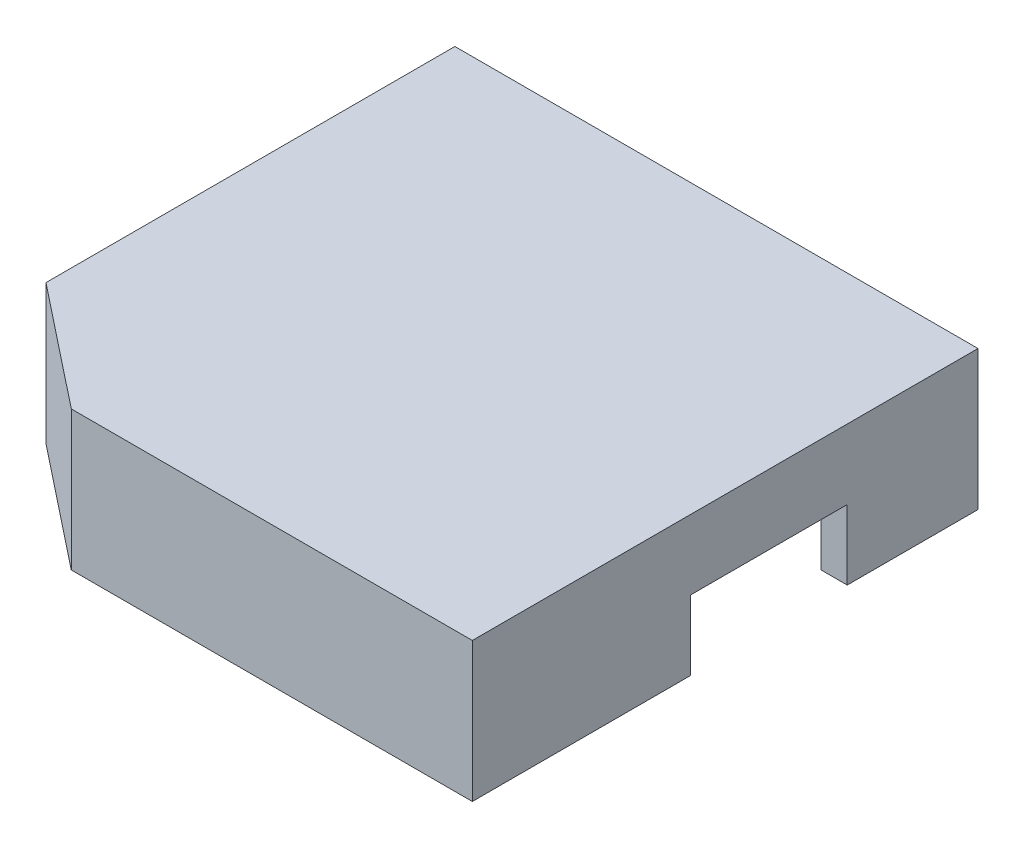
ISO-10303-21;
HEADER;
FILE_DESCRIPTION(('STEP AP214'),'2;1');
FILE_NAME('part.step','',(''),(''),'','','');
FILE_SCHEMA(('AUTOMOTIVE_DESIGN { 1 0 10303 214 1 1 1 1 }'));
ENDSEC;
DATA;
#1=APPLICATION_CONTEXT('core data for automotive mechanical design processes');
#2=APPLICATION_PROTOCOL_DEFINITION('international standard','automotive_design',2000,#1);
#3=PRODUCT_CONTEXT('',#1,'mechanical');
#4=PRODUCT('Part','Part','',(#3));
#5=PRODUCT_RELATED_PRODUCT_CATEGORY('part','',(#4));
#6=PRODUCT_DEFINITION_FORMATION('','',#4);
#7=PRODUCT_DEFINITION_CONTEXT('part definition',#1,'design');
#8=PRODUCT_DEFINITION('design','',#6,#7);
#9=PRODUCT_DEFINITION_SHAPE('','',#8);
#10=(LENGTH_UNIT() NAMED_UNIT(*) SI_UNIT(.MILLI.,.METRE.));
#11=(NAMED_UNIT(*) PLANE_ANGLE_UNIT() SI_UNIT($,.RADIAN.));
#12=(NAMED_UNIT(*) SI_UNIT($,.STERADIAN.) SOLID_ANGLE_UNIT());
#13=UNCERTAINTY_MEASURE_WITH_UNIT(LENGTH_MEASURE(1.E-05),#10,'distance_accuracy_value','');
#14=(GEOMETRIC_REPRESENTATION_CONTEXT(3) GLOBAL_UNCERTAINTY_ASSIGNED_CONTEXT((#13)) GLOBAL_UNIT_ASSIGNED_CONTEXT((#10,
#11,#12)) REPRESENTATION_CONTEXT('',''));
#15=CARTESIAN_POINT('',(0.,0.,0.));
#16=DIRECTION('',(0.,0.,1.));
#17=DIRECTION('',(1.,0.,0.));
#18=AXIS2_PLACEMENT_3D('',#15,#16,#17);
#19=CARTESIAN_POINT('',(0.,0.,0.));
#20=DIRECTION('',(0.,1.,0.));
#21=DIRECTION('',(0.,0.,1.));
#22=AXIS2_PLACEMENT_3D('',#19,#20,#21);
#23=PLANE('',#22);
#24=DIRECTION('',(0.,0.,-1.));
#25=VECTOR('',#24,1.);
#26=CARTESIAN_POINT('',(0.763392857142857,0.,-0.930803571428571));
#27=LINE('',#26,#25);
#28=CARTESIAN_POINT('',(0.763392857142872,0.,6.56919642857143));
#29=VERTEX_POINT('',#28);
#30=CARTESIAN_POINT('',(0.763392857142857,0.,-0.930803571428571));
#31=VERTEX_POINT('',#30);
#32=EDGE_CURVE('E184',#29,#31,#27,.T.);
#33=ORIENTED_EDGE('',*,*,#32,.F.);
#34=DIRECTION('',(-1.,0.,0.));
#35=VECTOR('',#34,1.);
#36=CARTESIAN_POINT('',(0.763392857142872,0.,6.56919642857143));
#37=LINE('',#36,#35);
#38=CARTESIAN_POINT('',(-0.736607142857139,0.,6.56919642857143));
#39=VERTEX_POINT('',#38);
#40=EDGE_CURVE('E165',#29,#39,#37,.T.);
#41=ORIENTED_EDGE('',*,*,#40,.T.);
#42=DIRECTION('',(0.,0.,1.));
#43=VECTOR('',#42,1.);
#44=CARTESIAN_POINT('',(-0.736607142857139,0.,0.569196428571429));
#45=LINE('',#44,#43);
#46=CARTESIAN_POINT('',(-0.736607142857139,0.,0.569196428571429));
#47=VERTEX_POINT('',#46);
#48=EDGE_CURVE('E284',#47,#39,#45,.T.);
#49=ORIENTED_EDGE('',*,*,#48,.F.);
#50=DIRECTION('',(1.,0.,0.));
#51=VECTOR('',#50,1.);
#52=CARTESIAN_POINT('',(-0.736607142857139,0.,0.569196428571429));
#53=LINE('',#52,#51);
#54=CARTESIAN_POINT('',(-27.7366071428571,0.,0.569196428571426));
#55=VERTEX_POINT('',#54);
#56=EDGE_CURVE('E267',#55,#47,#53,.T.);
#57=ORIENTED_EDGE('',*,*,#56,.F.);
#58=DIRECTION('',(0.,0.,-1.));
#59=VECTOR('',#58,1.);
#60=CARTESIAN_POINT('',(-27.7366071428571,0.,0.569196428571426));
#61=LINE('',#60,#59);
#62=CARTESIAN_POINT('',(-27.7366071428571,0.,6.56919642857143));
#63=VERTEX_POINT('',#62);
#64=EDGE_CURVE('E295',#63,#55,#61,.T.);
#65=ORIENTED_EDGE('',*,*,#64,.F.);
#66=CARTESIAN_POINT('',(-29.2366071428571,0.,6.56919642857143));
#67=VERTEX_POINT('',#66);
#68=EDGE_CURVE('E179',#63,#67,#37,.T.);
#69=ORIENTED_EDGE('',*,*,#68,.T.);
#70=DIRECTION('',(0.,0.,1.));
#71=VECTOR('',#70,1.);
#72=CARTESIAN_POINT('',(-29.2366071428571,0.,-0.930803571428571));
#73=LINE('',#72,#71);
#74=CARTESIAN_POINT('',(-29.2366071428571,0.,-0.930803571428571));
#75=VERTEX_POINT('',#74);
#76=EDGE_CURVE('E203',#75,#67,#73,.T.);
#77=ORIENTED_EDGE('',*,*,#76,.F.);
#78=DIRECTION('',(-1.,0.,0.));
#79=VECTOR('',#78,1.);
#80=CARTESIAN_POINT('',(-29.2366071428571,0.,-0.930803571428571));
#81=LINE('',#80,#79);
#82=EDGE_CURVE('E195',#31,#75,#81,.T.);
#83=ORIENTED_EDGE('',*,*,#82,.F.);
#84=EDGE_LOOP('',(#33,#41,#49,#57,#65,#69,#77,#83));
#85=FACE_BOUND('',#84,.T.);
#86=ADVANCED_FACE('F39',(#85),#23,.F.);
#87=CARTESIAN_POINT('',(-29.2366071428571,8.,-0.930803571428571));
#88=DIRECTION('',(1.,0.,0.));
#89=DIRECTION('',(0.,0.,-1.));
#90=AXIS2_PLACEMENT_3D('',#87,#88,#89);
#91=PLANE('',#90);
#92=ORIENTED_EDGE('',*,*,#76,.T.);
#93=DIRECTION('',(0.,-1.,0.));
#94=VECTOR('',#93,1.);
#95=CARTESIAN_POINT('',(-29.2366071428571,0.,6.56919642857143));
#96=LINE('',#95,#94);
#97=CARTESIAN_POINT('',(-29.2366071428571,4.,6.56919642857143));
#98=VERTEX_POINT('',#97);
#99=EDGE_CURVE('E379',#98,#67,#96,.T.);
#100=ORIENTED_EDGE('',*,*,#99,.F.);
#101=DIRECTION('',(0.,0.,-1.));
#102=VECTOR('',#101,1.);
#103=CARTESIAN_POINT('',(-29.2366071428571,4.,6.56919642857143));
#104=LINE('',#103,#102);
#105=CARTESIAN_POINT('',(-29.2366071428571,4.,15.5691964285714));
#106=VERTEX_POINT('',#105);
#107=EDGE_CURVE('E191',#106,#98,#104,.T.);
#108=ORIENTED_EDGE('',*,*,#107,.F.);
#109=DIRECTION('',(0.,1.,0.));
#110=VECTOR('',#109,1.);
#111=CARTESIAN_POINT('',(-29.2366071428571,0.,15.5691964285714));
#112=LINE('',#111,#110);
#113=CARTESIAN_POINT('',(-29.2366071428571,0.,15.5691964285714));
#114=VERTEX_POINT('',#113);
#115=EDGE_CURVE('E351',#114,#106,#112,.T.);
#116=ORIENTED_EDGE('',*,*,#115,.F.);
#117=CARTESIAN_POINT('',(-29.2366071428571,0.,22.5191407492151));
#118=VERTEX_POINT('',#117);
#119=EDGE_CURVE('E330',#114,#118,#73,.T.);
#120=ORIENTED_EDGE('',*,*,#119,.T.);
#121=DIRECTION('',(0.,1.,0.));
#122=VECTOR('',#121,1.);
#123=CARTESIAN_POINT('',(-29.2366071428571,0.,22.5191407492151));
#124=LINE('',#123,#122);
#125=CARTESIAN_POINT('',(-29.2366071428571,8.,22.5191407492151));
#126=VERTEX_POINT('',#125);
#127=EDGE_CURVE('E326',#118,#126,#124,.T.);
#128=ORIENTED_EDGE('',*,*,#127,.T.);
#129=DIRECTION('',(0.,0.,1.));
#130=VECTOR('',#129,1.);
#131=CARTESIAN_POINT('',(-29.2366071428571,8.,-0.930803571428571));
#132=LINE('',#131,#130);
#133=CARTESIAN_POINT('',(-29.2366071428571,8.,-0.930803571428571));
#134=VERTEX_POINT('',#133);
#135=EDGE_CURVE('E209',#134,#126,#132,.T.);
#136=ORIENTED_EDGE('',*,*,#135,.F.);
#137=DIRECTION('',(0.,-1.,0.));
#138=VECTOR('',#137,1.);
#139=CARTESIAN_POINT('',(-29.2366071428571,8.,-0.930803571428571));
#140=LINE('',#139,#138);
#141=EDGE_CURVE('E210',#134,#75,#140,.T.);
#142=ORIENTED_EDGE('',*,*,#141,.T.);
#143=EDGE_LOOP('',(#92,#100,#108,#116,#120,#128,#136,#142));
#144=FACE_BOUND('',#143,.T.);
#145=ADVANCED_FACE('F41',(#144),#91,.F.);
#146=CARTESIAN_POINT('',(-29.2366071428571,8.,28.0691964285714));
#147=DIRECTION('',(0.,0.,-1.));
#148=DIRECTION('',(-1.,0.,0.));
#149=AXIS2_PLACEMENT_3D('',#146,#147,#148);
#150=PLANE('',#149);
#151=DIRECTION('',(1.,0.,0.));
#152=VECTOR('',#151,1.);
#153=CARTESIAN_POINT('',(-29.2366071428571,8.,28.0691964285714));
#154=LINE('',#153,#152);
#155=CARTESIAN_POINT('',(-22.2366071428571,8.,28.0691964285714));
#156=VERTEX_POINT('',#155);
#157=CARTESIAN_POINT('',(0.763392857142861,8.,28.0691964285714));
#158=VERTEX_POINT('',#157);
#159=EDGE_CURVE('E336',#156,#158,#154,.T.);
#160=ORIENTED_EDGE('',*,*,#159,.F.);
#161=DIRECTION('',(0.,1.,0.));
#162=VECTOR('',#161,1.);
#163=CARTESIAN_POINT('',(-22.2366071428571,0.,28.0691964285714));
#164=LINE('',#163,#162);
#165=CARTESIAN_POINT('',(-22.2366071428571,0.,28.0691964285714));
#166=VERTEX_POINT('',#165);
#167=EDGE_CURVE('E323',#166,#156,#164,.T.);
#168=ORIENTED_EDGE('',*,*,#167,.F.);
#169=DIRECTION('',(1.,0.,0.));
#170=VECTOR('',#169,1.);
#171=CARTESIAN_POINT('',(-29.2366071428571,0.,28.0691964285714));
#172=LINE('',#171,#170);
#173=CARTESIAN_POINT('',(0.763392857142861,0.,28.0691964285714));
#174=VERTEX_POINT('',#173);
#175=EDGE_CURVE('E198',#166,#174,#172,.T.);
#176=ORIENTED_EDGE('',*,*,#175,.T.);
#177=DIRECTION('',(0.,-1.,0.));
#178=VECTOR('',#177,1.);
#179=CARTESIAN_POINT('',(0.763392857142861,8.,28.0691964285714));
#180=LINE('',#179,#178);
#181=EDGE_CURVE('E218',#158,#174,#180,.T.);
#182=ORIENTED_EDGE('',*,*,#181,.F.);
#183=EDGE_LOOP('',(#160,#168,#176,#182));
#184=FACE_BOUND('',#183,.T.);
#185=ADVANCED_FACE('F364',(#184),#150,.F.);
#186=CARTESIAN_POINT('',(0.763392857142857,8.,-0.930803571428571));
#187=DIRECTION('',(-1.,0.,0.));
#188=DIRECTION('',(0.,0.,1.));
#189=AXIS2_PLACEMENT_3D('',#186,#187,#188);
#190=PLANE('',#189);
#191=DIRECTION('',(0.,0.,-1.));
#192=VECTOR('',#191,1.);
#193=CARTESIAN_POINT('',(0.763392857142872,4.,6.56919642857143));
#194=LINE('',#193,#192);
#195=CARTESIAN_POINT('',(0.763392857142876,4.,15.5691964285714));
#196=VERTEX_POINT('',#195);
#197=CARTESIAN_POINT('',(0.763392857142872,4.,6.56919642857143));
#198=VERTEX_POINT('',#197);
#199=EDGE_CURVE('E188',#196,#198,#194,.T.);
#200=ORIENTED_EDGE('',*,*,#199,.T.);
#201=DIRECTION('',(0.,-1.,0.));
#202=VECTOR('',#201,1.);
#203=CARTESIAN_POINT('',(0.763392857142872,0.,6.56919642857143));
#204=LINE('',#203,#202);
#205=EDGE_CURVE('E169',#198,#29,#204,.T.);
#206=ORIENTED_EDGE('',*,*,#205,.T.);
#207=ORIENTED_EDGE('',*,*,#32,.T.);
#208=DIRECTION('',(0.,-1.,0.));
#209=VECTOR('',#208,1.);
#210=CARTESIAN_POINT('',(0.763392857142857,8.,-0.930803571428571));
#211=LINE('',#210,#209);
#212=CARTESIAN_POINT('',(0.763392857142857,8.,-0.930803571428571));
#213=VERTEX_POINT('',#212);
#214=EDGE_CURVE('E214',#213,#31,#211,.T.);
#215=ORIENTED_EDGE('',*,*,#214,.F.);
#216=DIRECTION('',(0.,0.,-1.));
#217=VECTOR('',#216,1.);
#218=CARTESIAN_POINT('',(0.763392857142857,8.,-0.930803571428571));
#219=LINE('',#218,#217);
#220=EDGE_CURVE('E339',#158,#213,#219,.T.);
#221=ORIENTED_EDGE('',*,*,#220,.F.);
#222=ORIENTED_EDGE('',*,*,#181,.T.);
#223=CARTESIAN_POINT('',(0.763392857142876,0.,15.5691964285714));
#224=VERTEX_POINT('',#223);
#225=EDGE_CURVE('E197',#174,#224,#27,.T.);
#226=ORIENTED_EDGE('',*,*,#225,.T.);
#227=DIRECTION('',(0.,1.,0.));
#228=VECTOR('',#227,1.);
#229=CARTESIAN_POINT('',(0.763392857142876,0.,15.5691964285714));
#230=LINE('',#229,#228);
#231=EDGE_CURVE('E190',#224,#196,#230,.T.);
#232=ORIENTED_EDGE('',*,*,#231,.T.);
#233=EDGE_LOOP('',(#200,#206,#207,#215,#221,#222,#226,#232));
#234=FACE_BOUND('',#233,.T.);
#235=ADVANCED_FACE('F182',(#234),#190,.F.);
#236=CARTESIAN_POINT('',(-29.2366071428571,8.,-0.930803571428571));
#237=DIRECTION('',(0.,0.,1.));
#238=DIRECTION('',(1.,0.,0.));
#239=AXIS2_PLACEMENT_3D('',#236,#237,#238);
#240=PLANE('',#239);
#241=ORIENTED_EDGE('',*,*,#82,.T.);
#242=ORIENTED_EDGE('',*,*,#141,.F.);
#243=DIRECTION('',(-1.,0.,0.));
#244=VECTOR('',#243,1.);
#245=CARTESIAN_POINT('',(-29.2366071428571,8.,-0.930803571428571));
#246=LINE('',#245,#244);
#247=EDGE_CURVE('E215',#213,#134,#246,.T.);
#248=ORIENTED_EDGE('',*,*,#247,.F.);
#249=ORIENTED_EDGE('',*,*,#214,.T.);
#250=EDGE_LOOP('',(#241,#242,#248,#249));
#251=FACE_BOUND('',#250,.T.);
#252=ADVANCED_FACE('F409',(#251),#240,.F.);
#253=CARTESIAN_POINT('',(0.,8.,0.));
#254=DIRECTION('',(0.,1.,0.));
#255=DIRECTION('',(0.,0.,1.));
#256=AXIS2_PLACEMENT_3D('',#253,#254,#255);
#257=PLANE('',#256);
#258=DIRECTION('',(-0.783588601449101,0.,-0.621280052535925));
#259=VECTOR('',#258,1.);
#260=CARTESIAN_POINT('',(-29.2366071428571,8.,22.5191407492151));
#261=LINE('',#260,#259);
#262=EDGE_CURVE('E305',#156,#126,#261,.T.);
#263=ORIENTED_EDGE('',*,*,#262,.F.);
#264=ORIENTED_EDGE('',*,*,#159,.T.);
#265=ORIENTED_EDGE('',*,*,#220,.T.);
#266=ORIENTED_EDGE('',*,*,#247,.T.);
#267=ORIENTED_EDGE('',*,*,#135,.T.);
#268=EDGE_LOOP('',(#263,#264,#265,#266,#267));
#269=FACE_BOUND('',#268,.T.);
#270=ADVANCED_FACE('F368',(#269),#257,.T.);
#271=ORIENTED_EDGE('',*,*,#119,.F.);
#272=DIRECTION('',(-1.,0.,0.));
#273=VECTOR('',#272,1.);
#274=CARTESIAN_POINT('',(0.763392857142876,0.,15.5691964285714));
#275=LINE('',#274,#273);
#276=CARTESIAN_POINT('',(-27.7366071428571,0.,15.5691964285714));
#277=VERTEX_POINT('',#276);
#278=EDGE_CURVE('E178',#277,#114,#275,.T.);
#279=ORIENTED_EDGE('',*,*,#278,.F.);
#280=CARTESIAN_POINT('',(-27.7366071428571,0.,21.7941685888933));
#281=VERTEX_POINT('',#280);
#282=EDGE_CURVE('E296',#281,#277,#61,.T.);
#283=ORIENTED_EDGE('',*,*,#282,.F.);
#284=DIRECTION('',(-0.783588601449101,0.,-0.621280052535925));
#285=VECTOR('',#284,1.);
#286=CARTESIAN_POINT('',(-27.7366071428571,0.,21.7941685888933));
#287=LINE('',#286,#285);
#288=CARTESIAN_POINT('',(-21.714109926825,0.,26.5691964285714));
#289=VERTEX_POINT('',#288);
#290=EDGE_CURVE('E291',#289,#281,#287,.T.);
#291=ORIENTED_EDGE('',*,*,#290,.F.);
#292=DIRECTION('',(-1.,0.,0.));
#293=VECTOR('',#292,1.);
#294=CARTESIAN_POINT('',(-21.714109926825,0.,26.5691964285714));
#295=LINE('',#294,#293);
#296=CARTESIAN_POINT('',(-0.73660714285714,0.,26.5691964285714));
#297=VERTEX_POINT('',#296);
#298=EDGE_CURVE('E287',#297,#289,#295,.T.);
#299=ORIENTED_EDGE('',*,*,#298,.F.);
#300=CARTESIAN_POINT('',(-0.736607142857139,0.,15.5691964285714));
#301=VERTEX_POINT('',#300);
#302=EDGE_CURVE('E261',#301,#297,#45,.T.);
#303=ORIENTED_EDGE('',*,*,#302,.F.);
#304=EDGE_CURVE('E55',#224,#301,#275,.T.);
#305=ORIENTED_EDGE('',*,*,#304,.F.);
#306=ORIENTED_EDGE('',*,*,#225,.F.);
#307=ORIENTED_EDGE('',*,*,#175,.F.);
#308=DIRECTION('',(-0.783588601449101,0.,-0.621280052535925));
#309=VECTOR('',#308,1.);
#310=CARTESIAN_POINT('',(-29.2366071428571,0.,22.5191407492151));
#311=LINE('',#310,#309);
#312=EDGE_CURVE('E319',#166,#118,#311,.T.);
#313=ORIENTED_EDGE('',*,*,#312,.T.);
#314=EDGE_LOOP('',(#271,#279,#283,#291,#299,#303,#305,#306,#307,#313));
#315=FACE_BOUND('',#314,.T.);
#316=ADVANCED_FACE('F359',(#315),#23,.F.);
#317=CARTESIAN_POINT('',(-29.2366071428571,0.,22.5191407492151));
#318=DIRECTION('',(0.621280052535925,0.,-0.783588601449101));
#319=DIRECTION('',(-0.783588601449101,0.,-0.621280052535925));
#320=AXIS2_PLACEMENT_3D('',#317,#318,#319);
#321=PLANE('',#320);
#322=ORIENTED_EDGE('',*,*,#262,.T.);
#323=ORIENTED_EDGE('',*,*,#127,.F.);
#324=ORIENTED_EDGE('',*,*,#312,.F.);
#325=ORIENTED_EDGE('',*,*,#167,.T.);
#326=EDGE_LOOP('',(#322,#323,#324,#325));
#327=FACE_BOUND('',#326,.T.);
#328=ADVANCED_FACE('F355',(#327),#321,.F.);
#329=CARTESIAN_POINT('',(0.,5.,0.));
#330=DIRECTION('',(0.,1.,0.));
#331=DIRECTION('',(0.,0.,1.));
#332=AXIS2_PLACEMENT_3D('',#329,#330,#331);
#333=PLANE('',#332);
#334=DIRECTION('',(0.,0.,1.));
#335=VECTOR('',#334,1.);
#336=CARTESIAN_POINT('',(-0.736607142857139,5.,0.569196428571429));
#337=LINE('',#336,#335);
#338=CARTESIAN_POINT('',(-0.736607142857139,5.,0.569196428571429));
#339=VERTEX_POINT('',#338);
#340=CARTESIAN_POINT('',(-0.73660714285714,5.,26.5691964285714));
#341=VERTEX_POINT('',#340);
#342=EDGE_CURVE('E262',#339,#341,#337,.T.);
#343=ORIENTED_EDGE('',*,*,#342,.T.);
#344=DIRECTION('',(-1.,0.,0.));
#345=VECTOR('',#344,1.);
#346=CARTESIAN_POINT('',(-21.714109926825,5.,26.5691964285714));
#347=LINE('',#346,#345);
#348=CARTESIAN_POINT('',(-21.714109926825,5.,26.5691964285714));
#349=VERTEX_POINT('',#348);
#350=EDGE_CURVE('E266',#341,#349,#347,.T.);
#351=ORIENTED_EDGE('',*,*,#350,.T.);
#352=DIRECTION('',(-0.783588601449101,0.,-0.621280052535925));
#353=VECTOR('',#352,1.);
#354=CARTESIAN_POINT('',(-27.7366071428571,5.,21.7941685888933));
#355=LINE('',#354,#353);
#356=CARTESIAN_POINT('',(-27.7366071428571,5.,21.7941685888933));
#357=VERTEX_POINT('',#356);
#358=EDGE_CURVE('E271',#349,#357,#355,.T.);
#359=ORIENTED_EDGE('',*,*,#358,.T.);
#360=DIRECTION('',(0.,0.,-1.));
#361=VECTOR('',#360,1.);
#362=CARTESIAN_POINT('',(-27.7366071428571,5.,0.569196428571426));
#363=LINE('',#362,#361);
#364=CARTESIAN_POINT('',(-27.7366071428571,5.,0.569196428571426));
#365=VERTEX_POINT('',#364);
#366=EDGE_CURVE('E275',#357,#365,#363,.T.);
#367=ORIENTED_EDGE('',*,*,#366,.T.);
#368=DIRECTION('',(1.,0.,0.));
#369=VECTOR('',#368,1.);
#370=CARTESIAN_POINT('',(-0.736607142857139,5.,0.569196428571429));
#371=LINE('',#370,#369);
#372=EDGE_CURVE('E279',#365,#339,#371,.T.);
#373=ORIENTED_EDGE('',*,*,#372,.T.);
#374=EDGE_LOOP('',(#343,#351,#359,#367,#373));
#375=FACE_BOUND('',#374,.T.);
#376=ADVANCED_FACE('F407',(#375),#333,.F.);
#377=CARTESIAN_POINT('',(-0.736607142857139,5.,0.569196428571429));
#378=DIRECTION('',(1.,0.,0.));
#379=DIRECTION('',(0.,0.,-1.));
#380=AXIS2_PLACEMENT_3D('',#377,#378,#379);
#381=PLANE('',#380);
#382=ORIENTED_EDGE('',*,*,#48,.T.);
#383=DIRECTION('',(0.,1.,0.));
#384=VECTOR('',#383,1.);
#385=CARTESIAN_POINT('',(-0.736607142857139,5.,6.56919642857143));
#386=LINE('',#385,#384);
#387=CARTESIAN_POINT('',(-0.736607142857139,4.,6.56919642857143));
#388=VERTEX_POINT('',#387);
#389=EDGE_CURVE('E172',#39,#388,#386,.T.);
#390=ORIENTED_EDGE('',*,*,#389,.T.);
#391=DIRECTION('',(0.,0.,1.));
#392=VECTOR('',#391,1.);
#393=CARTESIAN_POINT('',(-0.736607142857139,4.,0.569196428571429));
#394=LINE('',#393,#392);
#395=CARTESIAN_POINT('',(-0.73660714285714,4.,15.5691964285714));
#396=VERTEX_POINT('',#395);
#397=EDGE_CURVE('E255',#388,#396,#394,.T.);
#398=ORIENTED_EDGE('',*,*,#397,.T.);
#399=DIRECTION('',(0.,-1.,0.));
#400=VECTOR('',#399,1.);
#401=CARTESIAN_POINT('',(-0.736607142857139,5.,15.5691964285714));
#402=LINE('',#401,#400);
#403=EDGE_CURVE('E245',#396,#301,#402,.T.);
#404=ORIENTED_EDGE('',*,*,#403,.T.);
#405=ORIENTED_EDGE('',*,*,#302,.T.);
#406=DIRECTION('',(0.,-1.,0.));
#407=VECTOR('',#406,1.);
#408=CARTESIAN_POINT('',(-0.73660714285714,5.,26.5691964285714));
#409=LINE('',#408,#407);
#410=EDGE_CURVE('E283',#341,#297,#409,.T.);
#411=ORIENTED_EDGE('',*,*,#410,.F.);
#412=ORIENTED_EDGE('',*,*,#342,.F.);
#413=DIRECTION('',(0.,-1.,0.));
#414=VECTOR('',#413,1.);
#415=CARTESIAN_POINT('',(-0.736607142857139,5.,0.569196428571429));
#416=LINE('',#415,#414);
#417=EDGE_CURVE('E302',#339,#47,#416,.T.);
#418=ORIENTED_EDGE('',*,*,#417,.T.);
#419=EDGE_LOOP('',(#382,#390,#398,#404,#405,#411,#412,#418));
#420=FACE_BOUND('',#419,.T.);
#421=ADVANCED_FACE('F414',(#420),#381,.F.);
#422=CARTESIAN_POINT('',(-0.736607142857139,5.,0.569196428571429));
#423=DIRECTION('',(0.,0.,-1.));
#424=DIRECTION('',(-1.,0.,0.));
#425=AXIS2_PLACEMENT_3D('',#422,#423,#424);
#426=PLANE('',#425);
#427=ORIENTED_EDGE('',*,*,#56,.T.);
#428=ORIENTED_EDGE('',*,*,#417,.F.);
#429=ORIENTED_EDGE('',*,*,#372,.F.);
#430=DIRECTION('',(0.,-1.,0.));
#431=VECTOR('',#430,1.);
#432=CARTESIAN_POINT('',(-27.7366071428571,5.,0.569196428571426));
#433=LINE('',#432,#431);
#434=EDGE_CURVE('E306',#365,#55,#433,.T.);
#435=ORIENTED_EDGE('',*,*,#434,.T.);
#436=EDGE_LOOP('',(#427,#428,#429,#435));
#437=FACE_BOUND('',#436,.T.);
#438=ADVANCED_FACE('F417',(#437),#426,.F.);
#439=CARTESIAN_POINT('',(-27.7366071428571,5.,0.569196428571426));
#440=DIRECTION('',(-1.,0.,0.));
#441=DIRECTION('',(0.,0.,1.));
#442=AXIS2_PLACEMENT_3D('',#439,#440,#441);
#443=PLANE('',#442);
#444=DIRECTION('',(0.,0.,-1.));
#445=VECTOR('',#444,1.);
#446=CARTESIAN_POINT('',(-27.7366071428571,4.,0.569196428571426));
#447=LINE('',#446,#445);
#448=CARTESIAN_POINT('',(-27.7366071428571,4.,15.5691964285714));
#449=VERTEX_POINT('',#448);
#450=CARTESIAN_POINT('',(-27.7366071428571,4.,6.56919642857143));
#451=VERTEX_POINT('',#450);
#452=EDGE_CURVE('E48',#449,#451,#447,.T.);
#453=ORIENTED_EDGE('',*,*,#452,.T.);
#454=DIRECTION('',(0.,-1.,0.));
#455=VECTOR('',#454,1.);
#456=CARTESIAN_POINT('',(-27.7366071428571,5.,6.56919642857143));
#457=LINE('',#456,#455);
#458=EDGE_CURVE('E11',#451,#63,#457,.T.);
#459=ORIENTED_EDGE('',*,*,#458,.T.);
#460=ORIENTED_EDGE('',*,*,#64,.T.);
#461=ORIENTED_EDGE('',*,*,#434,.F.);
#462=ORIENTED_EDGE('',*,*,#366,.F.);
#463=DIRECTION('',(0.,-1.,0.));
#464=VECTOR('',#463,1.);
#465=CARTESIAN_POINT('',(-27.7366071428571,5.,21.7941685888933));
#466=LINE('',#465,#464);
#467=EDGE_CURVE('E310',#357,#281,#466,.T.);
#468=ORIENTED_EDGE('',*,*,#467,.T.);
#469=ORIENTED_EDGE('',*,*,#282,.T.);
#470=DIRECTION('',(0.,1.,0.));
#471=VECTOR('',#470,1.);
#472=CARTESIAN_POINT('',(-27.7366071428571,5.,15.5691964285714));
#473=LINE('',#472,#471);
#474=EDGE_CURVE('E222',#277,#449,#473,.T.);
#475=ORIENTED_EDGE('',*,*,#474,.T.);
#476=EDGE_LOOP('',(#453,#459,#460,#461,#462,#468,#469,#475));
#477=FACE_BOUND('',#476,.T.);
#478=ADVANCED_FACE('F228',(#477),#443,.F.);
#479=CARTESIAN_POINT('',(-27.7366071428571,5.,21.7941685888933));
#480=DIRECTION('',(-0.621280052535925,0.,0.783588601449101));
#481=DIRECTION('',(0.783588601449101,0.,0.621280052535925));
#482=AXIS2_PLACEMENT_3D('',#479,#480,#481);
#483=PLANE('',#482);
#484=ORIENTED_EDGE('',*,*,#290,.T.);
#485=ORIENTED_EDGE('',*,*,#467,.F.);
#486=ORIENTED_EDGE('',*,*,#358,.F.);
#487=DIRECTION('',(0.,-1.,0.));
#488=VECTOR('',#487,1.);
#489=CARTESIAN_POINT('',(-21.714109926825,5.,26.5691964285714));
#490=LINE('',#489,#488);
#491=EDGE_CURVE('E313',#349,#289,#490,.T.);
#492=ORIENTED_EDGE('',*,*,#491,.T.);
#493=EDGE_LOOP('',(#484,#485,#486,#492));
#494=FACE_BOUND('',#493,.T.);
#495=ADVANCED_FACE('F422',(#494),#483,.F.);
#496=CARTESIAN_POINT('',(-21.714109926825,5.,26.5691964285714));
#497=DIRECTION('',(0.,0.,1.));
#498=DIRECTION('',(1.,0.,0.));
#499=AXIS2_PLACEMENT_3D('',#496,#497,#498);
#500=PLANE('',#499);
#501=ORIENTED_EDGE('',*,*,#298,.T.);
#502=ORIENTED_EDGE('',*,*,#491,.F.);
#503=ORIENTED_EDGE('',*,*,#350,.F.);
#504=ORIENTED_EDGE('',*,*,#410,.T.);
#505=EDGE_LOOP('',(#501,#502,#503,#504));
#506=FACE_BOUND('',#505,.T.);
#507=ADVANCED_FACE('F419',(#506),#500,.F.);
#508=CARTESIAN_POINT('',(0.763392857142876,0.,15.5691964285714));
#509=DIRECTION('',(0.,0.,1.));
#510=DIRECTION('',(1.,0.,0.));
#511=AXIS2_PLACEMENT_3D('',#508,#509,#510);
#512=PLANE('',#511);
#513=ORIENTED_EDGE('',*,*,#278,.T.);
#514=ORIENTED_EDGE('',*,*,#115,.T.);
#515=DIRECTION('',(-1.,0.,0.));
#516=VECTOR('',#515,1.);
#517=CARTESIAN_POINT('',(0.763392857142876,4.,15.5691964285714));
#518=LINE('',#517,#516);
#519=EDGE_CURVE('E63',#449,#106,#518,.T.);
#520=ORIENTED_EDGE('',*,*,#519,.F.);
#521=ORIENTED_EDGE('',*,*,#474,.F.);
#522=EDGE_LOOP('',(#513,#514,#520,#521));
#523=FACE_BOUND('',#522,.T.);
#524=ADVANCED_FACE('F383',(#523),#512,.F.);
#525=CARTESIAN_POINT('',(0.763392857142872,4.,6.56919642857143));
#526=DIRECTION('',(0.,1.,0.));
#527=DIRECTION('',(0.,0.,1.));
#528=AXIS2_PLACEMENT_3D('',#525,#526,#527);
#529=PLANE('',#528);
#530=ORIENTED_EDGE('',*,*,#519,.T.);
#531=ORIENTED_EDGE('',*,*,#107,.T.);
#532=DIRECTION('',(-1.,0.,0.));
#533=VECTOR('',#532,1.);
#534=CARTESIAN_POINT('',(0.763392857142872,4.,6.56919642857143));
#535=LINE('',#534,#533);
#536=EDGE_CURVE('E235',#451,#98,#535,.T.);
#537=ORIENTED_EDGE('',*,*,#536,.F.);
#538=ORIENTED_EDGE('',*,*,#452,.F.);
#539=EDGE_LOOP('',(#530,#531,#537,#538));
#540=FACE_BOUND('',#539,.T.);
#541=ADVANCED_FACE('F233',(#540),#529,.F.);
#542=CARTESIAN_POINT('',(0.763392857142872,0.,6.56919642857143));
#543=DIRECTION('',(0.,0.,-1.));
#544=DIRECTION('',(-1.,0.,0.));
#545=AXIS2_PLACEMENT_3D('',#542,#543,#544);
#546=PLANE('',#545);
#547=ORIENTED_EDGE('',*,*,#536,.T.);
#548=ORIENTED_EDGE('',*,*,#99,.T.);
#549=ORIENTED_EDGE('',*,*,#68,.F.);
#550=ORIENTED_EDGE('',*,*,#458,.F.);
#551=EDGE_LOOP('',(#547,#548,#549,#550));
#552=FACE_BOUND('',#551,.T.);
#553=ADVANCED_FACE('F384',(#552),#546,.F.);
#554=ORIENTED_EDGE('',*,*,#40,.F.);
#555=ORIENTED_EDGE('',*,*,#205,.F.);
#556=EDGE_CURVE('E240',#198,#388,#535,.T.);
#557=ORIENTED_EDGE('',*,*,#556,.T.);
#558=ORIENTED_EDGE('',*,*,#389,.F.);
#559=EDGE_LOOP('',(#554,#555,#557,#558));
#560=FACE_BOUND('',#559,.T.);
#561=ADVANCED_FACE('F167',(#560),#546,.F.);
#562=ORIENTED_EDGE('',*,*,#556,.F.);
#563=ORIENTED_EDGE('',*,*,#199,.F.);
#564=EDGE_CURVE('E241',#196,#396,#518,.T.);
#565=ORIENTED_EDGE('',*,*,#564,.T.);
#566=ORIENTED_EDGE('',*,*,#397,.F.);
#567=EDGE_LOOP('',(#562,#563,#565,#566));
#568=FACE_BOUND('',#567,.T.);
#569=ADVANCED_FACE('F391',(#568),#529,.F.);
#570=ORIENTED_EDGE('',*,*,#564,.F.);
#571=ORIENTED_EDGE('',*,*,#231,.F.);
#572=ORIENTED_EDGE('',*,*,#304,.T.);
#573=ORIENTED_EDGE('',*,*,#403,.F.);
#574=EDGE_LOOP('',(#570,#571,#572,#573));
#575=FACE_BOUND('',#574,.T.);
#576=ADVANCED_FACE('F444',(#575),#512,.F.);
#577=CLOSED_SHELL('',(#86,#145,#185,#235,#252,#270,#316,#328,#376,#421,#438,#478,#495,#507,#524,
#541,#553,#561,#569,#576));
#578=MANIFOLD_SOLID_BREP('B2',#577);
#579=ADVANCED_BREP_SHAPE_REPRESENTATION('',(#18,#578),#14);
#580=SHAPE_DEFINITION_REPRESENTATION(#9,#579);
ENDSEC;
END-ISO-10303-21;
